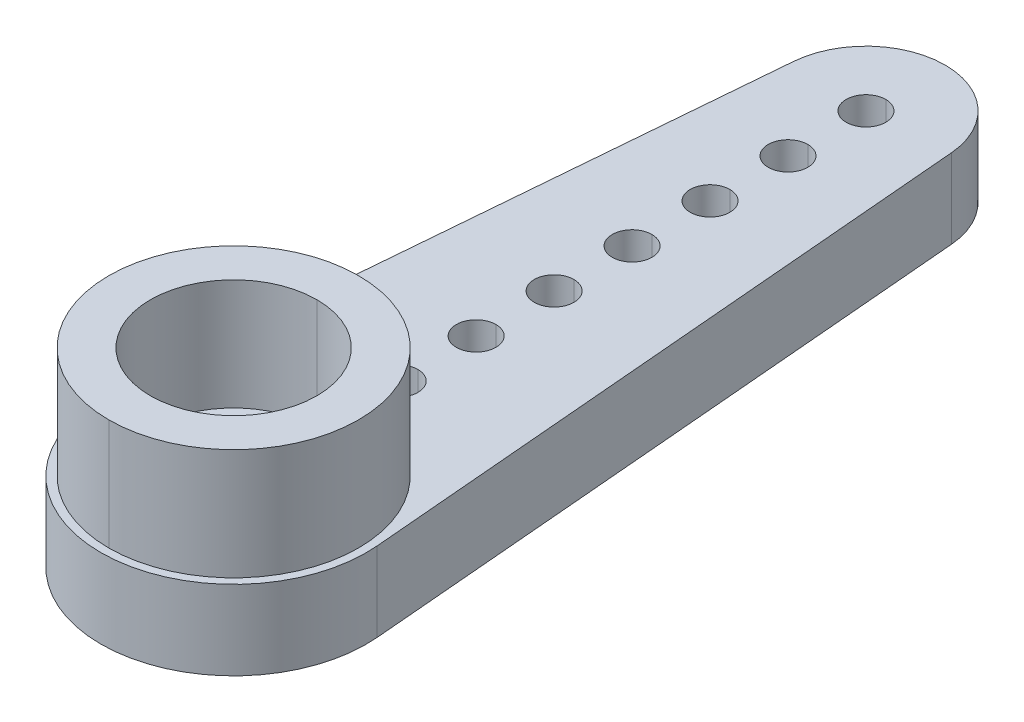
ISO-10303-21;
HEADER;
FILE_DESCRIPTION(('STEP AP214'),'2;1');
FILE_NAME('part.step','',(''),(''),'','','');
FILE_SCHEMA(('AUTOMOTIVE_DESIGN { 1 0 10303 214 1 1 1 1 }'));
ENDSEC;
DATA;
#1=APPLICATION_CONTEXT('core data for automotive mechanical design processes');
#2=APPLICATION_PROTOCOL_DEFINITION('international standard','automotive_design',2000,#1);
#3=PRODUCT_CONTEXT('',#1,'mechanical');
#4=PRODUCT('Part','Part','',(#3));
#5=PRODUCT_RELATED_PRODUCT_CATEGORY('part','',(#4));
#6=PRODUCT_DEFINITION_FORMATION('','',#4);
#7=PRODUCT_DEFINITION_CONTEXT('part definition',#1,'design');
#8=PRODUCT_DEFINITION('design','',#6,#7);
#9=PRODUCT_DEFINITION_SHAPE('','',#8);
#10=(LENGTH_UNIT() NAMED_UNIT(*) SI_UNIT(.MILLI.,.METRE.));
#11=(NAMED_UNIT(*) PLANE_ANGLE_UNIT() SI_UNIT($,.RADIAN.));
#12=(NAMED_UNIT(*) SI_UNIT($,.STERADIAN.) SOLID_ANGLE_UNIT());
#13=UNCERTAINTY_MEASURE_WITH_UNIT(LENGTH_MEASURE(1.E-05),#10,'distance_accuracy_value','');
#14=(GEOMETRIC_REPRESENTATION_CONTEXT(3) GLOBAL_UNCERTAINTY_ASSIGNED_CONTEXT((#13)) GLOBAL_UNIT_ASSIGNED_CONTEXT((#10,
#11,#12)) REPRESENTATION_CONTEXT('',''));
#15=CARTESIAN_POINT('',(0.,0.,0.));
#16=DIRECTION('',(0.,0.,1.));
#17=DIRECTION('',(1.,0.,0.));
#18=AXIS2_PLACEMENT_3D('',#15,#16,#17);
#19=CARTESIAN_POINT('',(0.,4.8,0.));
#20=DIRECTION('',(0.,-1.,0.));
#21=DIRECTION('',(0.,0.,-1.));
#22=AXIS2_PLACEMENT_3D('',#19,#20,#21);
#23=CYLINDRICAL_SURFACE('',#22,2.1);
#24=DIRECTION('',(0.,-1.,0.));
#25=VECTOR('',#24,1.);
#26=CARTESIAN_POINT('',(0.,4.8,2.1));
#27=LINE('',#26,#25);
#28=CARTESIAN_POINT('',(0.,4.8,2.1));
#29=VERTEX_POINT('',#28);
#30=CARTESIAN_POINT('',(0.,2.,2.1));
#31=VERTEX_POINT('',#30);
#32=EDGE_CURVE('E243',#29,#31,#27,.T.);
#33=ORIENTED_EDGE('',*,*,#32,.F.);
#34=CARTESIAN_POINT('',(0.,4.8,0.));
#35=DIRECTION('',(0.,1.,0.));
#36=DIRECTION('',(0.,0.,1.));
#37=AXIS2_PLACEMENT_3D('',#34,#35,#36);
#38=CIRCLE('',#37,2.1);
#39=CARTESIAN_POINT('',(0.,4.8,-2.1));
#40=VERTEX_POINT('',#39);
#41=EDGE_CURVE('E10',#29,#40,#38,.T.);
#42=ORIENTED_EDGE('',*,*,#41,.T.);
#43=DIRECTION('',(0.,-1.,0.));
#44=VECTOR('',#43,1.);
#45=CARTESIAN_POINT('',(0.,4.8,-2.1));
#46=LINE('',#45,#44);
#47=CARTESIAN_POINT('',(0.,2.,-2.1));
#48=VERTEX_POINT('',#47);
#49=EDGE_CURVE('E242',#40,#48,#46,.T.);
#50=ORIENTED_EDGE('',*,*,#49,.T.);
#51=CARTESIAN_POINT('',(0.,2.,0.));
#52=DIRECTION('',(0.,-1.,0.));
#53=DIRECTION('',(0.,0.,1.));
#54=AXIS2_PLACEMENT_3D('',#51,#52,#53);
#55=CIRCLE('',#54,2.1);
#56=EDGE_CURVE('E272',#48,#31,#55,.T.);
#57=ORIENTED_EDGE('',*,*,#56,.T.);
#58=EDGE_LOOP('',(#33,#42,#50,#57));
#59=FACE_BOUND('',#58,.T.);
#60=ADVANCED_FACE('F15',(#59),#23,.F.);
#61=CARTESIAN_POINT('',(0.,4.8,0.));
#62=DIRECTION('',(0.,-1.,0.));
#63=DIRECTION('',(0.,0.,-1.));
#64=AXIS2_PLACEMENT_3D('',#61,#62,#63);
#65=CYLINDRICAL_SURFACE('',#64,3.15);
#66=DIRECTION('',(0.,-1.,0.));
#67=VECTOR('',#66,1.);
#68=CARTESIAN_POINT('',(0.,4.8,3.15));
#69=LINE('',#68,#67);
#70=CARTESIAN_POINT('',(0.,4.8,3.15));
#71=VERTEX_POINT('',#70);
#72=CARTESIAN_POINT('',(0.,2.,3.15));
#73=VERTEX_POINT('',#72);
#74=EDGE_CURVE('E421',#71,#73,#69,.T.);
#75=ORIENTED_EDGE('',*,*,#74,.F.);
#76=CARTESIAN_POINT('',(0.,4.8,0.));
#77=DIRECTION('',(0.,1.,0.));
#78=DIRECTION('',(0.,0.,1.));
#79=AXIS2_PLACEMENT_3D('',#76,#77,#78);
#80=CIRCLE('',#79,3.15);
#81=CARTESIAN_POINT('',(0.,4.8,-3.15));
#82=VERTEX_POINT('',#81);
#83=EDGE_CURVE('E26',#82,#71,#80,.T.);
#84=ORIENTED_EDGE('',*,*,#83,.F.);
#85=DIRECTION('',(0.,-1.,0.));
#86=VECTOR('',#85,1.);
#87=CARTESIAN_POINT('',(0.,4.8,-3.15));
#88=LINE('',#87,#86);
#89=CARTESIAN_POINT('',(0.,2.,-3.15));
#90=VERTEX_POINT('',#89);
#91=EDGE_CURVE('E278',#82,#90,#88,.T.);
#92=ORIENTED_EDGE('',*,*,#91,.T.);
#93=CARTESIAN_POINT('',(0.,2.,0.));
#94=DIRECTION('',(0.,-1.,0.));
#95=DIRECTION('',(0.,0.,1.));
#96=AXIS2_PLACEMENT_3D('',#93,#94,#95);
#97=CIRCLE('',#96,3.15);
#98=EDGE_CURVE('E207',#73,#90,#97,.T.);
#99=ORIENTED_EDGE('',*,*,#98,.F.);
#100=EDGE_LOOP('',(#75,#84,#92,#99));
#101=FACE_BOUND('',#100,.T.);
#102=ADVANCED_FACE('F900',(#101),#65,.T.);
#103=CARTESIAN_POINT('',(0.,4.8,0.));
#104=DIRECTION('',(0.,1.,0.));
#105=DIRECTION('',(1.,0.,0.));
#106=AXIS2_PLACEMENT_3D('',#103,#104,#105);
#107=PLANE('',#106);
#108=CARTESIAN_POINT('',(0.,4.8,0.));
#109=DIRECTION('',(0.,1.,0.));
#110=DIRECTION('',(0.,0.,1.));
#111=AXIS2_PLACEMENT_3D('',#108,#109,#110);
#112=CIRCLE('',#111,2.1);
#113=EDGE_CURVE('E255',#40,#29,#112,.T.);
#114=ORIENTED_EDGE('',*,*,#113,.F.);
#115=ORIENTED_EDGE('',*,*,#41,.F.);
#116=EDGE_LOOP('',(#114,#115));
#117=FACE_BOUND('',#116,.T.);
#118=ORIENTED_EDGE('',*,*,#83,.T.);
#119=CARTESIAN_POINT('',(0.,4.8,0.));
#120=DIRECTION('',(0.,1.,0.));
#121=DIRECTION('',(0.,0.,1.));
#122=AXIS2_PLACEMENT_3D('',#119,#120,#121);
#123=CIRCLE('',#122,3.15);
#124=EDGE_CURVE('E425',#71,#82,#123,.T.);
#125=ORIENTED_EDGE('',*,*,#124,.T.);
#126=EDGE_LOOP('',(#118,#125));
#127=FACE_BOUND('',#126,.T.);
#128=ADVANCED_FACE('F794',(#117,#127),#107,.T.);
#129=CARTESIAN_POINT('',(1.23120827143379E-13,2.,-4.15));
#130=DIRECTION('',(0.,-1.,0.));
#131=DIRECTION('',(0.,0.,-1.));
#132=AXIS2_PLACEMENT_3D('',#129,#130,#131);
#133=CYLINDRICAL_SURFACE('',#132,0.5);
#134=DIRECTION('',(0.,-1.,0.));
#135=VECTOR('',#134,1.);
#136=CARTESIAN_POINT('',(1.23182059483337E-13,2.,-3.65));
#137=LINE('',#136,#135);
#138=CARTESIAN_POINT('',(1.23182059483337E-13,2.,-3.65));
#139=VERTEX_POINT('',#138);
#140=CARTESIAN_POINT('',(1.23182059483337E-13,0.,-3.65));
#141=VERTEX_POINT('',#140);
#142=EDGE_CURVE('E277',#139,#141,#137,.T.);
#143=ORIENTED_EDGE('',*,*,#142,.F.);
#144=CARTESIAN_POINT('',(1.23120827143379E-13,2.,-4.15));
#145=DIRECTION('',(0.,1.,0.));
#146=DIRECTION('',(0.,0.,1.));
#147=AXIS2_PLACEMENT_3D('',#144,#145,#146);
#148=CIRCLE('',#147,0.5);
#149=CARTESIAN_POINT('',(1.23120827143379E-13,2.,-4.65));
#150=VERTEX_POINT('',#149);
#151=EDGE_CURVE('E357',#139,#150,#148,.T.);
#152=ORIENTED_EDGE('',*,*,#151,.T.);
#153=DIRECTION('',(0.,-1.,0.));
#154=VECTOR('',#153,1.);
#155=CARTESIAN_POINT('',(1.23120827143379E-13,2.,-4.65));
#156=LINE('',#155,#154);
#157=CARTESIAN_POINT('',(1.23120827143379E-13,0.,-4.65));
#158=VERTEX_POINT('',#157);
#159=EDGE_CURVE('E222',#150,#158,#156,.T.);
#160=ORIENTED_EDGE('',*,*,#159,.T.);
#161=CARTESIAN_POINT('',(1.23120827143379E-13,0.,-4.15));
#162=DIRECTION('',(0.,1.,0.));
#163=DIRECTION('',(0.,0.,1.));
#164=AXIS2_PLACEMENT_3D('',#161,#162,#163);
#165=CIRCLE('',#164,0.5);
#166=EDGE_CURVE('E234',#141,#158,#165,.T.);
#167=ORIENTED_EDGE('',*,*,#166,.F.);
#168=EDGE_LOOP('',(#143,#152,#160,#167));
#169=FACE_BOUND('',#168,.T.);
#170=ADVANCED_FACE('F790',(#169),#133,.F.);
#171=CARTESIAN_POINT('',(1.02641510846121E-13,2.,-6.11666666666666));
#172=DIRECTION('',(0.,-1.,0.));
#173=DIRECTION('',(0.,0.,-1.));
#174=AXIS2_PLACEMENT_3D('',#171,#172,#173);
#175=CYLINDRICAL_SURFACE('',#174,0.5);
#176=DIRECTION('',(0.,-1.,0.));
#177=VECTOR('',#176,1.);
#178=CARTESIAN_POINT('',(1.02702743186078E-13,2.,-5.61666666666666));
#179=LINE('',#178,#177);
#180=CARTESIAN_POINT('',(1.02702743186078E-13,2.,-5.61666666666666));
#181=VERTEX_POINT('',#180);
#182=CARTESIAN_POINT('',(1.02702743186078E-13,0.,-5.61666666666666));
#183=VERTEX_POINT('',#182);
#184=EDGE_CURVE('E210',#181,#183,#179,.T.);
#185=ORIENTED_EDGE('',*,*,#184,.F.);
#186=CARTESIAN_POINT('',(1.02641510846121E-13,2.,-6.11666666666666));
#187=DIRECTION('',(0.,1.,0.));
#188=DIRECTION('',(0.,0.,1.));
#189=AXIS2_PLACEMENT_3D('',#186,#187,#188);
#190=CIRCLE('',#189,0.5);
#191=CARTESIAN_POINT('',(1.02641510846121E-13,2.,-6.61666666666666));
#192=VERTEX_POINT('',#191);
#193=EDGE_CURVE('E196',#181,#192,#190,.T.);
#194=ORIENTED_EDGE('',*,*,#193,.T.);
#195=DIRECTION('',(0.,-1.,0.));
#196=VECTOR('',#195,1.);
#197=CARTESIAN_POINT('',(1.02641510846121E-13,2.,-6.61666666666666));
#198=LINE('',#197,#196);
#199=CARTESIAN_POINT('',(1.02641510846121E-13,0.,-6.61666666666666));
#200=VERTEX_POINT('',#199);
#201=EDGE_CURVE('E220',#192,#200,#198,.T.);
#202=ORIENTED_EDGE('',*,*,#201,.T.);
#203=CARTESIAN_POINT('',(1.02641510846121E-13,0.,-6.11666666666666));
#204=DIRECTION('',(0.,1.,0.));
#205=DIRECTION('',(0.,0.,1.));
#206=AXIS2_PLACEMENT_3D('',#203,#204,#205);
#207=CIRCLE('',#206,0.5);
#208=EDGE_CURVE('E212',#183,#200,#207,.T.);
#209=ORIENTED_EDGE('',*,*,#208,.F.);
#210=EDGE_LOOP('',(#185,#194,#202,#209));
#211=FACE_BOUND('',#210,.T.);
#212=ADVANCED_FACE('F211',(#211),#175,.F.);
#213=CARTESIAN_POINT('',(0.,2.,-8.08333333333333));
#214=DIRECTION('',(0.,-1.,0.));
#215=DIRECTION('',(0.,0.,-1.));
#216=AXIS2_PLACEMENT_3D('',#213,#214,#215);
#217=CYLINDRICAL_SURFACE('',#216,0.5);
#218=DIRECTION('',(0.,-1.,0.));
#219=VECTOR('',#218,1.);
#220=CARTESIAN_POINT('',(0.,2.,-7.58333333333333));
#221=LINE('',#220,#219);
#222=CARTESIAN_POINT('',(0.,2.,-7.58333333333333));
#223=VERTEX_POINT('',#222);
#224=CARTESIAN_POINT('',(0.,0.,-7.58333333333333));
#225=VERTEX_POINT('',#224);
#226=EDGE_CURVE('E306',#223,#225,#221,.T.);
#227=ORIENTED_EDGE('',*,*,#226,.F.);
#228=CARTESIAN_POINT('',(0.,2.,-8.08333333333333));
#229=DIRECTION('',(0.,1.,0.));
#230=DIRECTION('',(0.,0.,1.));
#231=AXIS2_PLACEMENT_3D('',#228,#229,#230);
#232=CIRCLE('',#231,0.5);
#233=CARTESIAN_POINT('',(0.,2.,-8.58333333333333));
#234=VERTEX_POINT('',#233);
#235=EDGE_CURVE('E323',#223,#234,#232,.T.);
#236=ORIENTED_EDGE('',*,*,#235,.T.);
#237=DIRECTION('',(0.,-1.,0.));
#238=VECTOR('',#237,1.);
#239=CARTESIAN_POINT('',(0.,2.,-8.58333333333333));
#240=LINE('',#239,#238);
#241=CARTESIAN_POINT('',(0.,0.,-8.58333333333333));
#242=VERTEX_POINT('',#241);
#243=EDGE_CURVE('E301',#234,#242,#240,.T.);
#244=ORIENTED_EDGE('',*,*,#243,.T.);
#245=CARTESIAN_POINT('',(0.,0.,-8.08333333333333));
#246=DIRECTION('',(0.,1.,0.));
#247=DIRECTION('',(0.,0.,1.));
#248=AXIS2_PLACEMENT_3D('',#245,#246,#247);
#249=CIRCLE('',#248,0.5);
#250=EDGE_CURVE('E340',#225,#242,#249,.T.);
#251=ORIENTED_EDGE('',*,*,#250,.F.);
#252=EDGE_LOOP('',(#227,#236,#244,#251));
#253=FACE_BOUND('',#252,.T.);
#254=ADVANCED_FACE('F552',(#253),#217,.F.);
#255=CARTESIAN_POINT('',(0.,2.,-10.05));
#256=DIRECTION('',(0.,-1.,0.));
#257=DIRECTION('',(0.,0.,-1.));
#258=AXIS2_PLACEMENT_3D('',#255,#256,#257);
#259=CYLINDRICAL_SURFACE('',#258,0.5);
#260=DIRECTION('',(0.,-1.,0.));
#261=VECTOR('',#260,1.);
#262=CARTESIAN_POINT('',(0.,2.,-9.55));
#263=LINE('',#262,#261);
#264=CARTESIAN_POINT('',(0.,2.,-9.55));
#265=VERTEX_POINT('',#264);
#266=CARTESIAN_POINT('',(0.,0.,-9.55));
#267=VERTEX_POINT('',#266);
#268=EDGE_CURVE('E282',#265,#267,#263,.T.);
#269=ORIENTED_EDGE('',*,*,#268,.F.);
#270=CARTESIAN_POINT('',(0.,2.,-10.05));
#271=DIRECTION('',(0.,1.,0.));
#272=DIRECTION('',(0.,0.,1.));
#273=AXIS2_PLACEMENT_3D('',#270,#271,#272);
#274=CIRCLE('',#273,0.5);
#275=CARTESIAN_POINT('',(0.,2.,-10.55));
#276=VERTEX_POINT('',#275);
#277=EDGE_CURVE('E206',#265,#276,#274,.T.);
#278=ORIENTED_EDGE('',*,*,#277,.T.);
#279=DIRECTION('',(0.,-1.,0.));
#280=VECTOR('',#279,1.);
#281=CARTESIAN_POINT('',(0.,2.,-10.55));
#282=LINE('',#281,#280);
#283=CARTESIAN_POINT('',(0.,0.,-10.55));
#284=VERTEX_POINT('',#283);
#285=EDGE_CURVE('E380',#276,#284,#282,.T.);
#286=ORIENTED_EDGE('',*,*,#285,.T.);
#287=CARTESIAN_POINT('',(0.,0.,-10.05));
#288=DIRECTION('',(0.,1.,0.));
#289=DIRECTION('',(0.,0.,1.));
#290=AXIS2_PLACEMENT_3D('',#287,#288,#289);
#291=CIRCLE('',#290,0.5);
#292=EDGE_CURVE('E337',#267,#284,#291,.T.);
#293=ORIENTED_EDGE('',*,*,#292,.F.);
#294=EDGE_LOOP('',(#269,#278,#286,#293));
#295=FACE_BOUND('',#294,.T.);
#296=ADVANCED_FACE('F579',(#295),#259,.F.);
#297=CARTESIAN_POINT('',(0.,2.,-12.0166666666667));
#298=DIRECTION('',(0.,-1.,0.));
#299=DIRECTION('',(0.,0.,-1.));
#300=AXIS2_PLACEMENT_3D('',#297,#298,#299);
#301=CYLINDRICAL_SURFACE('',#300,0.5);
#302=DIRECTION('',(0.,-1.,0.));
#303=VECTOR('',#302,1.);
#304=CARTESIAN_POINT('',(0.,2.,-11.5166666666667));
#305=LINE('',#304,#303);
#306=CARTESIAN_POINT('',(0.,2.,-11.5166666666667));
#307=VERTEX_POINT('',#306);
#308=CARTESIAN_POINT('',(0.,0.,-11.5166666666667));
#309=VERTEX_POINT('',#308);
#310=EDGE_CURVE('E244',#307,#309,#305,.T.);
#311=ORIENTED_EDGE('',*,*,#310,.F.);
#312=CARTESIAN_POINT('',(0.,2.,-12.0166666666667));
#313=DIRECTION('',(0.,1.,0.));
#314=DIRECTION('',(0.,0.,1.));
#315=AXIS2_PLACEMENT_3D('',#312,#313,#314);
#316=CIRCLE('',#315,0.5);
#317=CARTESIAN_POINT('',(0.,2.,-12.5166666666667));
#318=VERTEX_POINT('',#317);
#319=EDGE_CURVE('E319',#307,#318,#316,.T.);
#320=ORIENTED_EDGE('',*,*,#319,.T.);
#321=DIRECTION('',(0.,-1.,0.));
#322=VECTOR('',#321,1.);
#323=CARTESIAN_POINT('',(0.,2.,-12.5166666666667));
#324=LINE('',#323,#322);
#325=CARTESIAN_POINT('',(0.,0.,-12.5166666666667));
#326=VERTEX_POINT('',#325);
#327=EDGE_CURVE('E395',#318,#326,#324,.T.);
#328=ORIENTED_EDGE('',*,*,#327,.T.);
#329=CARTESIAN_POINT('',(0.,0.,-12.0166666666667));
#330=DIRECTION('',(0.,1.,0.));
#331=DIRECTION('',(0.,0.,1.));
#332=AXIS2_PLACEMENT_3D('',#329,#330,#331);
#333=CIRCLE('',#332,0.5);
#334=EDGE_CURVE('E341',#309,#326,#333,.T.);
#335=ORIENTED_EDGE('',*,*,#334,.F.);
#336=EDGE_LOOP('',(#311,#320,#328,#335));
#337=FACE_BOUND('',#336,.T.);
#338=ADVANCED_FACE('F933',(#337),#301,.F.);
#339=CARTESIAN_POINT('',(0.,2.,-13.9833333333333));
#340=DIRECTION('',(0.,-1.,0.));
#341=DIRECTION('',(0.,0.,-1.));
#342=AXIS2_PLACEMENT_3D('',#339,#340,#341);
#343=CYLINDRICAL_SURFACE('',#342,0.5);
#344=DIRECTION('',(0.,-1.,0.));
#345=VECTOR('',#344,1.);
#346=CARTESIAN_POINT('',(0.,2.,-13.4833333333333));
#347=LINE('',#346,#345);
#348=CARTESIAN_POINT('',(0.,2.,-13.4833333333333));
#349=VERTEX_POINT('',#348);
#350=CARTESIAN_POINT('',(0.,0.,-13.4833333333333));
#351=VERTEX_POINT('',#350);
#352=EDGE_CURVE('E254',#349,#351,#347,.T.);
#353=ORIENTED_EDGE('',*,*,#352,.F.);
#354=CARTESIAN_POINT('',(0.,2.,-13.9833333333333));
#355=DIRECTION('',(0.,1.,0.));
#356=DIRECTION('',(0.,0.,1.));
#357=AXIS2_PLACEMENT_3D('',#354,#355,#356);
#358=CIRCLE('',#357,0.5);
#359=CARTESIAN_POINT('',(0.,2.,-14.4833333333333));
#360=VERTEX_POINT('',#359);
#361=EDGE_CURVE('E307',#349,#360,#358,.T.);
#362=ORIENTED_EDGE('',*,*,#361,.T.);
#363=DIRECTION('',(0.,-1.,0.));
#364=VECTOR('',#363,1.);
#365=CARTESIAN_POINT('',(0.,2.,-14.4833333333333));
#366=LINE('',#365,#364);
#367=CARTESIAN_POINT('',(0.,0.,-14.4833333333333));
#368=VERTEX_POINT('',#367);
#369=EDGE_CURVE('E253',#360,#368,#366,.T.);
#370=ORIENTED_EDGE('',*,*,#369,.T.);
#371=CARTESIAN_POINT('',(0.,0.,-13.9833333333333));
#372=DIRECTION('',(0.,1.,0.));
#373=DIRECTION('',(0.,0.,1.));
#374=AXIS2_PLACEMENT_3D('',#371,#372,#373);
#375=CIRCLE('',#374,0.5);
#376=EDGE_CURVE('E403',#351,#368,#375,.T.);
#377=ORIENTED_EDGE('',*,*,#376,.F.);
#378=EDGE_LOOP('',(#353,#362,#370,#377));
#379=FACE_BOUND('',#378,.T.);
#380=ADVANCED_FACE('F590',(#379),#343,.F.);
#381=CARTESIAN_POINT('',(0.,2.,-15.95));
#382=DIRECTION('',(0.,-1.,0.));
#383=DIRECTION('',(0.,0.,-1.));
#384=AXIS2_PLACEMENT_3D('',#381,#382,#383);
#385=CYLINDRICAL_SURFACE('',#384,0.5);
#386=DIRECTION('',(0.,-1.,0.));
#387=VECTOR('',#386,1.);
#388=CARTESIAN_POINT('',(0.,2.,-15.45));
#389=LINE('',#388,#387);
#390=CARTESIAN_POINT('',(0.,2.,-15.45));
#391=VERTEX_POINT('',#390);
#392=CARTESIAN_POINT('',(0.,0.,-15.45));
#393=VERTEX_POINT('',#392);
#394=EDGE_CURVE('E336',#391,#393,#389,.T.);
#395=ORIENTED_EDGE('',*,*,#394,.F.);
#396=CARTESIAN_POINT('',(0.,2.,-15.95));
#397=DIRECTION('',(0.,1.,0.));
#398=DIRECTION('',(0.,0.,1.));
#399=AXIS2_PLACEMENT_3D('',#396,#397,#398);
#400=CIRCLE('',#399,0.5);
#401=CARTESIAN_POINT('',(0.,2.,-16.45));
#402=VERTEX_POINT('',#401);
#403=EDGE_CURVE('E310',#391,#402,#400,.T.);
#404=ORIENTED_EDGE('',*,*,#403,.T.);
#405=DIRECTION('',(0.,-1.,0.));
#406=VECTOR('',#405,1.);
#407=CARTESIAN_POINT('',(0.,2.,-16.45));
#408=LINE('',#407,#406);
#409=CARTESIAN_POINT('',(0.,0.,-16.45));
#410=VERTEX_POINT('',#409);
#411=EDGE_CURVE('E346',#402,#410,#408,.T.);
#412=ORIENTED_EDGE('',*,*,#411,.T.);
#413=CARTESIAN_POINT('',(0.,0.,-15.95));
#414=DIRECTION('',(0.,1.,0.));
#415=DIRECTION('',(0.,0.,1.));
#416=AXIS2_PLACEMENT_3D('',#413,#414,#415);
#417=CIRCLE('',#416,0.5);
#418=EDGE_CURVE('E400',#393,#410,#417,.T.);
#419=ORIENTED_EDGE('',*,*,#418,.F.);
#420=EDGE_LOOP('',(#395,#404,#412,#419));
#421=FACE_BOUND('',#420,.T.);
#422=ADVANCED_FACE('F483',(#421),#385,.F.);
#423=CARTESIAN_POINT('',(0.,2.,0.));
#424=DIRECTION('',(0.,-1.,0.));
#425=DIRECTION('',(0.,0.,-1.));
#426=AXIS2_PLACEMENT_3D('',#423,#424,#425);
#427=CYLINDRICAL_SURFACE('',#426,1.15);
#428=DIRECTION('',(0.,-1.,0.));
#429=VECTOR('',#428,1.);
#430=CARTESIAN_POINT('',(0.,2.,1.15));
#431=LINE('',#430,#429);
#432=CARTESIAN_POINT('',(0.,2.,1.15));
#433=VERTEX_POINT('',#432);
#434=CARTESIAN_POINT('',(0.,0.,1.15));
#435=VERTEX_POINT('',#434);
#436=EDGE_CURVE('E324',#433,#435,#431,.T.);
#437=ORIENTED_EDGE('',*,*,#436,.F.);
#438=CARTESIAN_POINT('',(0.,2.,0.));
#439=DIRECTION('',(0.,1.,0.));
#440=DIRECTION('',(0.,0.,1.));
#441=AXIS2_PLACEMENT_3D('',#438,#439,#440);
#442=CIRCLE('',#441,1.15);
#443=CARTESIAN_POINT('',(0.,2.,-1.15));
#444=VERTEX_POINT('',#443);
#445=EDGE_CURVE('E268',#433,#444,#442,.T.);
#446=ORIENTED_EDGE('',*,*,#445,.T.);
#447=DIRECTION('',(0.,-1.,0.));
#448=VECTOR('',#447,1.);
#449=CARTESIAN_POINT('',(0.,2.,-1.15));
#450=LINE('',#449,#448);
#451=CARTESIAN_POINT('',(0.,0.,-1.15));
#452=VERTEX_POINT('',#451);
#453=EDGE_CURVE('E360',#444,#452,#450,.T.);
#454=ORIENTED_EDGE('',*,*,#453,.T.);
#455=CARTESIAN_POINT('',(0.,0.,0.));
#456=DIRECTION('',(0.,1.,0.));
#457=DIRECTION('',(0.,0.,1.));
#458=AXIS2_PLACEMENT_3D('',#455,#456,#457);
#459=CIRCLE('',#458,1.15);
#460=EDGE_CURVE('E237',#435,#452,#459,.T.);
#461=ORIENTED_EDGE('',*,*,#460,.F.);
#462=EDGE_LOOP('',(#437,#446,#454,#461));
#463=FACE_BOUND('',#462,.T.);
#464=ADVANCED_FACE('F855',(#463),#427,.F.);
#465=CARTESIAN_POINT('',(-3.33797899228129,2.,-0.283542319749215));
#466=DIRECTION('',(0.996411639486953,0.,0.0846394984326016));
#467=DIRECTION('',(0.,-1.,0.));
#468=AXIS2_PLACEMENT_3D('',#465,#466,#467);
#469=PLANE('',#468);
#470=DIRECTION('',(-0.0846394984326016,0.,0.996411639486953));
#471=VECTOR('',#470,1.);
#472=CARTESIAN_POINT('',(-3.33797899228129,0.,-0.283542319749215));
#473=LINE('',#472,#471);
#474=CARTESIAN_POINT('',(-1.99282327897391,0.,-16.1192789968652));
#475=VERTEX_POINT('',#474);
#476=CARTESIAN_POINT('',(-3.33797899228129,0.,-0.283542319749215));
#477=VERTEX_POINT('',#476);
#478=EDGE_CURVE('E356',#475,#477,#473,.T.);
#479=ORIENTED_EDGE('',*,*,#478,.T.);
#480=DIRECTION('',(0.,-1.,0.));
#481=VECTOR('',#480,1.);
#482=CARTESIAN_POINT('',(-3.33797899228129,2.,-0.283542319749215));
#483=LINE('',#482,#481);
#484=CARTESIAN_POINT('',(-3.33797899228129,2.,-0.283542319749215));
#485=VERTEX_POINT('',#484);
#486=EDGE_CURVE('E391',#485,#477,#483,.T.);
#487=ORIENTED_EDGE('',*,*,#486,.F.);
#488=DIRECTION('',(-0.0846394984326016,0.,0.996411639486953));
#489=VECTOR('',#488,1.);
#490=CARTESIAN_POINT('',(-3.33797899228129,2.,-0.283542319749215));
#491=LINE('',#490,#489);
#492=CARTESIAN_POINT('',(-1.99282327897391,2.,-16.1192789968652));
#493=VERTEX_POINT('',#492);
#494=EDGE_CURVE('E19',#493,#485,#491,.T.);
#495=ORIENTED_EDGE('',*,*,#494,.F.);
#496=DIRECTION('',(0.,-1.,0.));
#497=VECTOR('',#496,1.);
#498=CARTESIAN_POINT('',(-1.99282327897391,2.,-16.1192789968652));
#499=LINE('',#498,#497);
#500=EDGE_CURVE('E281',#493,#475,#499,.T.);
#501=ORIENTED_EDGE('',*,*,#500,.T.);
#502=EDGE_LOOP('',(#479,#487,#495,#501));
#503=FACE_BOUND('',#502,.T.);
#504=ADVANCED_FACE('F501',(#503),#469,.F.);
#505=CARTESIAN_POINT('',(0.,2.,-15.95));
#506=DIRECTION('',(0.,-1.,0.));
#507=DIRECTION('',(0.,0.,-1.));
#508=AXIS2_PLACEMENT_3D('',#505,#506,#507);
#509=CYLINDRICAL_SURFACE('',#508,2.);
#510=DIRECTION('',(0.,-1.,0.));
#511=VECTOR('',#510,1.);
#512=CARTESIAN_POINT('',(0.,2.,-17.95));
#513=LINE('',#512,#511);
#514=CARTESIAN_POINT('',(0.,2.,-17.95));
#515=VERTEX_POINT('',#514);
#516=CARTESIAN_POINT('',(0.,0.,-17.95));
#517=VERTEX_POINT('',#516);
#518=EDGE_CURVE('E262',#515,#517,#513,.T.);
#519=ORIENTED_EDGE('',*,*,#518,.F.);
#520=CARTESIAN_POINT('',(0.,2.,-15.95));
#521=DIRECTION('',(0.,1.,0.));
#522=DIRECTION('',(0.,0.,1.));
#523=AXIS2_PLACEMENT_3D('',#520,#521,#522);
#524=CIRCLE('',#523,2.);
#525=CARTESIAN_POINT('',(1.99282327897391,2.,-16.1192789968652));
#526=VERTEX_POINT('',#525);
#527=EDGE_CURVE('E314',#526,#515,#524,.T.);
#528=ORIENTED_EDGE('',*,*,#527,.F.);
#529=DIRECTION('',(0.,-1.,0.));
#530=VECTOR('',#529,1.);
#531=CARTESIAN_POINT('',(1.99282327897391,2.,-16.1192789968652));
#532=LINE('',#531,#530);
#533=CARTESIAN_POINT('',(1.99282327897391,0.,-16.1192789968652));
#534=VERTEX_POINT('',#533);
#535=EDGE_CURVE('E41',#526,#534,#532,.T.);
#536=ORIENTED_EDGE('',*,*,#535,.T.);
#537=CARTESIAN_POINT('',(0.,0.,-15.95));
#538=DIRECTION('',(0.,1.,0.));
#539=DIRECTION('',(0.,0.,1.));
#540=AXIS2_PLACEMENT_3D('',#537,#538,#539);
#541=CIRCLE('',#540,2.);
#542=EDGE_CURVE('E408',#534,#517,#541,.T.);
#543=ORIENTED_EDGE('',*,*,#542,.T.);
#544=EDGE_LOOP('',(#519,#528,#536,#543));
#545=FACE_BOUND('',#544,.T.);
#546=ADVANCED_FACE('F17',(#545),#509,.T.);
#547=CARTESIAN_POINT('',(1.99282327897391,2.,-16.1192789968652));
#548=DIRECTION('',(-0.996411639486953,0.,0.0846394984326016));
#549=DIRECTION('',(0.,1.,0.));
#550=AXIS2_PLACEMENT_3D('',#547,#548,#549);
#551=PLANE('',#550);
#552=DIRECTION('',(-0.0846394984326016,0.,-0.996411639486953));
#553=VECTOR('',#552,1.);
#554=CARTESIAN_POINT('',(1.99282327897391,0.,-16.1192789968652));
#555=LINE('',#554,#553);
#556=CARTESIAN_POINT('',(3.33797899228129,0.,-0.283542319749215));
#557=VERTEX_POINT('',#556);
#558=EDGE_CURVE('E404',#557,#534,#555,.T.);
#559=ORIENTED_EDGE('',*,*,#558,.T.);
#560=ORIENTED_EDGE('',*,*,#535,.F.);
#561=DIRECTION('',(-0.0846394984326016,0.,-0.996411639486953));
#562=VECTOR('',#561,1.);
#563=CARTESIAN_POINT('',(1.99282327897391,2.,-16.1192789968652));
#564=LINE('',#563,#562);
#565=CARTESIAN_POINT('',(3.33797899228129,2.,-0.283542319749215));
#566=VERTEX_POINT('',#565);
#567=EDGE_CURVE('E318',#566,#526,#564,.T.);
#568=ORIENTED_EDGE('',*,*,#567,.F.);
#569=DIRECTION('',(0.,-1.,0.));
#570=VECTOR('',#569,1.);
#571=CARTESIAN_POINT('',(3.33797899228129,2.,-0.283542319749215));
#572=LINE('',#571,#570);
#573=EDGE_CURVE('E393',#566,#557,#572,.T.);
#574=ORIENTED_EDGE('',*,*,#573,.T.);
#575=EDGE_LOOP('',(#559,#560,#568,#574));
#576=FACE_BOUND('',#575,.T.);
#577=ADVANCED_FACE('F784',(#576),#551,.F.);
#578=CARTESIAN_POINT('',(0.,2.,0.));
#579=DIRECTION('',(0.,-1.,0.));
#580=DIRECTION('',(0.,0.,-1.));
#581=AXIS2_PLACEMENT_3D('',#578,#579,#580);
#582=CYLINDRICAL_SURFACE('',#581,3.35);
#583=CARTESIAN_POINT('',(0.,0.,0.));
#584=DIRECTION('',(0.,1.,0.));
#585=DIRECTION('',(0.,0.,1.));
#586=AXIS2_PLACEMENT_3D('',#583,#584,#585);
#587=CIRCLE('',#586,3.35);
#588=EDGE_CURVE('E352',#477,#557,#587,.T.);
#589=ORIENTED_EDGE('',*,*,#588,.T.);
#590=ORIENTED_EDGE('',*,*,#573,.F.);
#591=CARTESIAN_POINT('',(0.,2.,0.));
#592=DIRECTION('',(0.,1.,0.));
#593=DIRECTION('',(0.,0.,1.));
#594=AXIS2_PLACEMENT_3D('',#591,#592,#593);
#595=CIRCLE('',#594,3.35);
#596=EDGE_CURVE('E271',#485,#566,#595,.T.);
#597=ORIENTED_EDGE('',*,*,#596,.F.);
#598=ORIENTED_EDGE('',*,*,#486,.T.);
#599=EDGE_LOOP('',(#589,#590,#597,#598));
#600=FACE_BOUND('',#599,.T.);
#601=ADVANCED_FACE('F488',(#600),#582,.T.);
#602=CARTESIAN_POINT('',(0.,0.,0.));
#603=DIRECTION('',(0.,1.,0.));
#604=DIRECTION('',(1.,0.,0.));
#605=AXIS2_PLACEMENT_3D('',#602,#603,#604);
#606=PLANE('',#605);
#607=CARTESIAN_POINT('',(0.,0.,0.));
#608=DIRECTION('',(0.,1.,0.));
#609=DIRECTION('',(0.,0.,1.));
#610=AXIS2_PLACEMENT_3D('',#607,#608,#609);
#611=CIRCLE('',#610,1.15);
#612=EDGE_CURVE('E328',#452,#435,#611,.T.);
#613=ORIENTED_EDGE('',*,*,#612,.T.);
#614=ORIENTED_EDGE('',*,*,#460,.T.);
#615=EDGE_LOOP('',(#613,#614));
#616=FACE_BOUND('',#615,.T.);
#617=CARTESIAN_POINT('',(1.23120827143379E-13,0.,-4.15));
#618=DIRECTION('',(0.,1.,0.));
#619=DIRECTION('',(0.,0.,1.));
#620=AXIS2_PLACEMENT_3D('',#617,#618,#619);
#621=CIRCLE('',#620,0.5);
#622=EDGE_CURVE('E229',#158,#141,#621,.T.);
#623=ORIENTED_EDGE('',*,*,#622,.T.);
#624=ORIENTED_EDGE('',*,*,#166,.T.);
#625=EDGE_LOOP('',(#623,#624));
#626=FACE_BOUND('',#625,.T.);
#627=CARTESIAN_POINT('',(1.02641510846121E-13,0.,-6.11666666666666));
#628=DIRECTION('',(0.,1.,0.));
#629=DIRECTION('',(0.,0.,1.));
#630=AXIS2_PLACEMENT_3D('',#627,#628,#629);
#631=CIRCLE('',#630,0.5);
#632=EDGE_CURVE('E217',#200,#183,#631,.T.);
#633=ORIENTED_EDGE('',*,*,#632,.T.);
#634=ORIENTED_EDGE('',*,*,#208,.T.);
#635=EDGE_LOOP('',(#633,#634));
#636=FACE_BOUND('',#635,.T.);
#637=CARTESIAN_POINT('',(0.,0.,-8.08333333333333));
#638=DIRECTION('',(0.,1.,0.));
#639=DIRECTION('',(0.,0.,1.));
#640=AXIS2_PLACEMENT_3D('',#637,#638,#639);
#641=CIRCLE('',#640,0.5);
#642=EDGE_CURVE('E302',#242,#225,#641,.T.);
#643=ORIENTED_EDGE('',*,*,#642,.T.);
#644=ORIENTED_EDGE('',*,*,#250,.T.);
#645=EDGE_LOOP('',(#643,#644));
#646=FACE_BOUND('',#645,.T.);
#647=CARTESIAN_POINT('',(0.,0.,-10.05));
#648=DIRECTION('',(0.,1.,0.));
#649=DIRECTION('',(0.,0.,1.));
#650=AXIS2_PLACEMENT_3D('',#647,#648,#649);
#651=CIRCLE('',#650,0.5);
#652=EDGE_CURVE('E286',#284,#267,#651,.T.);
#653=ORIENTED_EDGE('',*,*,#652,.T.);
#654=ORIENTED_EDGE('',*,*,#292,.T.);
#655=EDGE_LOOP('',(#653,#654));
#656=FACE_BOUND('',#655,.T.);
#657=CARTESIAN_POINT('',(0.,0.,-12.0166666666667));
#658=DIRECTION('',(0.,1.,0.));
#659=DIRECTION('',(0.,0.,1.));
#660=AXIS2_PLACEMENT_3D('',#657,#658,#659);
#661=CIRCLE('',#660,0.5);
#662=EDGE_CURVE('E233',#326,#309,#661,.T.);
#663=ORIENTED_EDGE('',*,*,#662,.T.);
#664=ORIENTED_EDGE('',*,*,#334,.T.);
#665=EDGE_LOOP('',(#663,#664));
#666=FACE_BOUND('',#665,.T.);
#667=CARTESIAN_POINT('',(0.,0.,-13.9833333333333));
#668=DIRECTION('',(0.,1.,0.));
#669=DIRECTION('',(0.,0.,1.));
#670=AXIS2_PLACEMENT_3D('',#667,#668,#669);
#671=CIRCLE('',#670,0.5);
#672=EDGE_CURVE('E249',#368,#351,#671,.T.);
#673=ORIENTED_EDGE('',*,*,#672,.T.);
#674=ORIENTED_EDGE('',*,*,#376,.T.);
#675=EDGE_LOOP('',(#673,#674));
#676=FACE_BOUND('',#675,.T.);
#677=CARTESIAN_POINT('',(0.,0.,-15.95));
#678=DIRECTION('',(0.,1.,0.));
#679=DIRECTION('',(0.,0.,1.));
#680=AXIS2_PLACEMENT_3D('',#677,#678,#679);
#681=CIRCLE('',#680,0.5);
#682=EDGE_CURVE('E342',#410,#393,#681,.T.);
#683=ORIENTED_EDGE('',*,*,#682,.T.);
#684=ORIENTED_EDGE('',*,*,#418,.T.);
#685=EDGE_LOOP('',(#683,#684));
#686=FACE_BOUND('',#685,.T.);
#687=ORIENTED_EDGE('',*,*,#588,.F.);
#688=ORIENTED_EDGE('',*,*,#478,.F.);
#689=CARTESIAN_POINT('',(0.,0.,-15.95));
#690=DIRECTION('',(0.,1.,0.));
#691=DIRECTION('',(0.,0.,1.));
#692=AXIS2_PLACEMENT_3D('',#689,#690,#691);
#693=CIRCLE('',#692,2.);
#694=EDGE_CURVE('E266',#517,#475,#693,.T.);
#695=ORIENTED_EDGE('',*,*,#694,.F.);
#696=ORIENTED_EDGE('',*,*,#542,.F.);
#697=ORIENTED_EDGE('',*,*,#558,.F.);
#698=EDGE_LOOP('',(#687,#688,#695,#696,#697));
#699=FACE_BOUND('',#698,.T.);
#700=ADVANCED_FACE('F485',(#616,#626,#636,#646,#656,#666,#676,#686,#699),#606,.F.);
#701=CARTESIAN_POINT('',(0.,2.,0.));
#702=DIRECTION('',(0.,1.,0.));
#703=DIRECTION('',(1.,0.,0.));
#704=AXIS2_PLACEMENT_3D('',#701,#702,#703);
#705=PLANE('',#704);
#706=CARTESIAN_POINT('',(1.23120827143379E-13,2.,-4.15));
#707=DIRECTION('',(0.,1.,0.));
#708=DIRECTION('',(0.,0.,1.));
#709=AXIS2_PLACEMENT_3D('',#706,#707,#708);
#710=CIRCLE('',#709,0.5);
#711=EDGE_CURVE('E273',#150,#139,#710,.T.);
#712=ORIENTED_EDGE('',*,*,#711,.F.);
#713=ORIENTED_EDGE('',*,*,#151,.F.);
#714=EDGE_LOOP('',(#712,#713));
#715=FACE_BOUND('',#714,.T.);
#716=CARTESIAN_POINT('',(0.,2.,-8.08333333333333));
#717=DIRECTION('',(0.,1.,0.));
#718=DIRECTION('',(0.,0.,1.));
#719=AXIS2_PLACEMENT_3D('',#716,#717,#718);
#720=CIRCLE('',#719,0.5);
#721=EDGE_CURVE('E261',#234,#223,#720,.T.);
#722=ORIENTED_EDGE('',*,*,#721,.F.);
#723=ORIENTED_EDGE('',*,*,#235,.F.);
#724=EDGE_LOOP('',(#722,#723));
#725=FACE_BOUND('',#724,.T.);
#726=CARTESIAN_POINT('',(0.,2.,-12.0166666666667));
#727=DIRECTION('',(0.,1.,0.));
#728=DIRECTION('',(0.,0.,1.));
#729=AXIS2_PLACEMENT_3D('',#726,#727,#728);
#730=CIRCLE('',#729,0.5);
#731=EDGE_CURVE('E248',#318,#307,#730,.T.);
#732=ORIENTED_EDGE('',*,*,#731,.F.);
#733=ORIENTED_EDGE('',*,*,#319,.F.);
#734=EDGE_LOOP('',(#732,#733));
#735=FACE_BOUND('',#734,.T.);
#736=CARTESIAN_POINT('',(0.,2.,-15.95));
#737=DIRECTION('',(0.,1.,0.));
#738=DIRECTION('',(0.,0.,1.));
#739=AXIS2_PLACEMENT_3D('',#736,#737,#738);
#740=CIRCLE('',#739,0.5);
#741=EDGE_CURVE('E291',#402,#391,#740,.T.);
#742=ORIENTED_EDGE('',*,*,#741,.F.);
#743=ORIENTED_EDGE('',*,*,#403,.F.);
#744=EDGE_LOOP('',(#742,#743));
#745=FACE_BOUND('',#744,.T.);
#746=CARTESIAN_POINT('',(0.,2.,-13.9833333333333));
#747=DIRECTION('',(0.,1.,0.));
#748=DIRECTION('',(0.,0.,1.));
#749=AXIS2_PLACEMENT_3D('',#746,#747,#748);
#750=CIRCLE('',#749,0.5);
#751=EDGE_CURVE('E399',#360,#349,#750,.T.);
#752=ORIENTED_EDGE('',*,*,#751,.F.);
#753=ORIENTED_EDGE('',*,*,#361,.F.);
#754=EDGE_LOOP('',(#752,#753));
#755=FACE_BOUND('',#754,.T.);
#756=CARTESIAN_POINT('',(0.,2.,-10.05));
#757=DIRECTION('',(0.,1.,0.));
#758=DIRECTION('',(0.,0.,1.));
#759=AXIS2_PLACEMENT_3D('',#756,#757,#758);
#760=CIRCLE('',#759,0.5);
#761=EDGE_CURVE('E287',#276,#265,#760,.T.);
#762=ORIENTED_EDGE('',*,*,#761,.F.);
#763=ORIENTED_EDGE('',*,*,#277,.F.);
#764=EDGE_LOOP('',(#762,#763));
#765=FACE_BOUND('',#764,.T.);
#766=CARTESIAN_POINT('',(1.02641510846121E-13,2.,-6.11666666666666));
#767=DIRECTION('',(0.,1.,0.));
#768=DIRECTION('',(0.,0.,1.));
#769=AXIS2_PLACEMENT_3D('',#766,#767,#768);
#770=CIRCLE('',#769,0.5);
#771=EDGE_CURVE('E201',#192,#181,#770,.T.);
#772=ORIENTED_EDGE('',*,*,#771,.F.);
#773=ORIENTED_EDGE('',*,*,#193,.F.);
#774=EDGE_LOOP('',(#772,#773));
#775=FACE_BOUND('',#774,.T.);
#776=CARTESIAN_POINT('',(0.,2.,0.));
#777=DIRECTION('',(0.,-1.,0.));
#778=DIRECTION('',(0.,0.,1.));
#779=AXIS2_PLACEMENT_3D('',#776,#777,#778);
#780=CIRCLE('',#779,3.15);
#781=EDGE_CURVE('E414',#90,#73,#780,.T.);
#782=ORIENTED_EDGE('',*,*,#781,.T.);
#783=ORIENTED_EDGE('',*,*,#98,.T.);
#784=EDGE_LOOP('',(#782,#783));
#785=FACE_BOUND('',#784,.T.);
#786=ORIENTED_EDGE('',*,*,#596,.T.);
#787=ORIENTED_EDGE('',*,*,#567,.T.);
#788=ORIENTED_EDGE('',*,*,#527,.T.);
#789=CARTESIAN_POINT('',(0.,2.,-15.95));
#790=DIRECTION('',(0.,1.,0.));
#791=DIRECTION('',(0.,0.,1.));
#792=AXIS2_PLACEMENT_3D('',#789,#790,#791);
#793=CIRCLE('',#792,2.);
#794=EDGE_CURVE('E267',#515,#493,#793,.T.);
#795=ORIENTED_EDGE('',*,*,#794,.T.);
#796=ORIENTED_EDGE('',*,*,#494,.T.);
#797=EDGE_LOOP('',(#786,#787,#788,#795,#796));
#798=FACE_BOUND('',#797,.T.);
#799=ADVANCED_FACE('F198',(#715,#725,#735,#745,#755,#765,#775,#785,#798),#705,.T.);
#800=CARTESIAN_POINT('',(0.,2.,0.));
#801=DIRECTION('',(0.,1.,0.));
#802=DIRECTION('',(1.,0.,0.));
#803=AXIS2_PLACEMENT_3D('',#800,#801,#802);
#804=PLANE('',#803);
#805=CARTESIAN_POINT('',(0.,2.,0.));
#806=DIRECTION('',(0.,1.,0.));
#807=DIRECTION('',(0.,0.,1.));
#808=AXIS2_PLACEMENT_3D('',#805,#806,#807);
#809=CIRCLE('',#808,1.15);
#810=EDGE_CURVE('E329',#444,#433,#809,.T.);
#811=ORIENTED_EDGE('',*,*,#810,.F.);
#812=ORIENTED_EDGE('',*,*,#445,.F.);
#813=EDGE_LOOP('',(#811,#812));
#814=FACE_BOUND('',#813,.T.);
#815=ORIENTED_EDGE('',*,*,#56,.F.);
#816=CARTESIAN_POINT('',(0.,2.,0.));
#817=DIRECTION('',(0.,-1.,0.));
#818=DIRECTION('',(0.,0.,1.));
#819=AXIS2_PLACEMENT_3D('',#816,#817,#818);
#820=CIRCLE('',#819,2.1);
#821=EDGE_CURVE('E238',#31,#48,#820,.T.);
#822=ORIENTED_EDGE('',*,*,#821,.F.);
#823=EDGE_LOOP('',(#815,#822));
#824=FACE_BOUND('',#823,.T.);
#825=ADVANCED_FACE('F563',(#814,#824),#804,.T.);
#826=CARTESIAN_POINT('',(0.,2.,-15.95));
#827=DIRECTION('',(0.,-1.,0.));
#828=DIRECTION('',(0.,0.,-1.));
#829=AXIS2_PLACEMENT_3D('',#826,#827,#828);
#830=CYLINDRICAL_SURFACE('',#829,2.);
#831=ORIENTED_EDGE('',*,*,#794,.F.);
#832=ORIENTED_EDGE('',*,*,#518,.T.);
#833=ORIENTED_EDGE('',*,*,#694,.T.);
#834=ORIENTED_EDGE('',*,*,#500,.F.);
#835=EDGE_LOOP('',(#831,#832,#833,#834));
#836=FACE_BOUND('',#835,.T.);
#837=ADVANCED_FACE('F505',(#836),#830,.T.);
#838=CARTESIAN_POINT('',(0.,2.,0.));
#839=DIRECTION('',(0.,-1.,0.));
#840=DIRECTION('',(0.,0.,-1.));
#841=AXIS2_PLACEMENT_3D('',#838,#839,#840);
#842=CYLINDRICAL_SURFACE('',#841,1.15);
#843=ORIENTED_EDGE('',*,*,#810,.T.);
#844=ORIENTED_EDGE('',*,*,#436,.T.);
#845=ORIENTED_EDGE('',*,*,#612,.F.);
#846=ORIENTED_EDGE('',*,*,#453,.F.);
#847=EDGE_LOOP('',(#843,#844,#845,#846));
#848=FACE_BOUND('',#847,.T.);
#849=ADVANCED_FACE('F816',(#848),#842,.F.);
#850=CARTESIAN_POINT('',(0.,2.,-15.95));
#851=DIRECTION('',(0.,-1.,0.));
#852=DIRECTION('',(0.,0.,-1.));
#853=AXIS2_PLACEMENT_3D('',#850,#851,#852);
#854=CYLINDRICAL_SURFACE('',#853,0.5);
#855=ORIENTED_EDGE('',*,*,#741,.T.);
#856=ORIENTED_EDGE('',*,*,#394,.T.);
#857=ORIENTED_EDGE('',*,*,#682,.F.);
#858=ORIENTED_EDGE('',*,*,#411,.F.);
#859=EDGE_LOOP('',(#855,#856,#857,#858));
#860=FACE_BOUND('',#859,.T.);
#861=ADVANCED_FACE('F479',(#860),#854,.F.);
#862=CARTESIAN_POINT('',(0.,2.,-13.9833333333333));
#863=DIRECTION('',(0.,-1.,0.));
#864=DIRECTION('',(0.,0.,-1.));
#865=AXIS2_PLACEMENT_3D('',#862,#863,#864);
#866=CYLINDRICAL_SURFACE('',#865,0.5);
#867=ORIENTED_EDGE('',*,*,#751,.T.);
#868=ORIENTED_EDGE('',*,*,#352,.T.);
#869=ORIENTED_EDGE('',*,*,#672,.F.);
#870=ORIENTED_EDGE('',*,*,#369,.F.);
#871=EDGE_LOOP('',(#867,#868,#869,#870));
#872=FACE_BOUND('',#871,.T.);
#873=ADVANCED_FACE('F588',(#872),#866,.F.);
#874=CARTESIAN_POINT('',(0.,2.,-12.0166666666667));
#875=DIRECTION('',(0.,-1.,0.));
#876=DIRECTION('',(0.,0.,-1.));
#877=AXIS2_PLACEMENT_3D('',#874,#875,#876);
#878=CYLINDRICAL_SURFACE('',#877,0.5);
#879=ORIENTED_EDGE('',*,*,#731,.T.);
#880=ORIENTED_EDGE('',*,*,#310,.T.);
#881=ORIENTED_EDGE('',*,*,#662,.F.);
#882=ORIENTED_EDGE('',*,*,#327,.F.);
#883=EDGE_LOOP('',(#879,#880,#881,#882));
#884=FACE_BOUND('',#883,.T.);
#885=ADVANCED_FACE('F841',(#884),#878,.F.);
#886=CARTESIAN_POINT('',(0.,2.,-10.05));
#887=DIRECTION('',(0.,-1.,0.));
#888=DIRECTION('',(0.,0.,-1.));
#889=AXIS2_PLACEMENT_3D('',#886,#887,#888);
#890=CYLINDRICAL_SURFACE('',#889,0.5);
#891=ORIENTED_EDGE('',*,*,#761,.T.);
#892=ORIENTED_EDGE('',*,*,#268,.T.);
#893=ORIENTED_EDGE('',*,*,#652,.F.);
#894=ORIENTED_EDGE('',*,*,#285,.F.);
#895=EDGE_LOOP('',(#891,#892,#893,#894));
#896=FACE_BOUND('',#895,.T.);
#897=ADVANCED_FACE('F576',(#896),#890,.F.);
#898=CARTESIAN_POINT('',(0.,2.,-8.08333333333333));
#899=DIRECTION('',(0.,-1.,0.));
#900=DIRECTION('',(0.,0.,-1.));
#901=AXIS2_PLACEMENT_3D('',#898,#899,#900);
#902=CYLINDRICAL_SURFACE('',#901,0.5);
#903=ORIENTED_EDGE('',*,*,#721,.T.);
#904=ORIENTED_EDGE('',*,*,#226,.T.);
#905=ORIENTED_EDGE('',*,*,#642,.F.);
#906=ORIENTED_EDGE('',*,*,#243,.F.);
#907=EDGE_LOOP('',(#903,#904,#905,#906));
#908=FACE_BOUND('',#907,.T.);
#909=ADVANCED_FACE('F558',(#908),#902,.F.);
#910=CARTESIAN_POINT('',(1.02641510846121E-13,2.,-6.11666666666666));
#911=DIRECTION('',(0.,-1.,0.));
#912=DIRECTION('',(0.,0.,-1.));
#913=AXIS2_PLACEMENT_3D('',#910,#911,#912);
#914=CYLINDRICAL_SURFACE('',#913,0.5);
#915=ORIENTED_EDGE('',*,*,#771,.T.);
#916=ORIENTED_EDGE('',*,*,#184,.T.);
#917=ORIENTED_EDGE('',*,*,#632,.F.);
#918=ORIENTED_EDGE('',*,*,#201,.F.);
#919=EDGE_LOOP('',(#915,#916,#917,#918));
#920=FACE_BOUND('',#919,.T.);
#921=ADVANCED_FACE('F219',(#920),#914,.F.);
#922=CARTESIAN_POINT('',(1.23120827143379E-13,2.,-4.15));
#923=DIRECTION('',(0.,-1.,0.));
#924=DIRECTION('',(0.,0.,-1.));
#925=AXIS2_PLACEMENT_3D('',#922,#923,#924);
#926=CYLINDRICAL_SURFACE('',#925,0.5);
#927=ORIENTED_EDGE('',*,*,#711,.T.);
#928=ORIENTED_EDGE('',*,*,#142,.T.);
#929=ORIENTED_EDGE('',*,*,#622,.F.);
#930=ORIENTED_EDGE('',*,*,#159,.F.);
#931=EDGE_LOOP('',(#927,#928,#929,#930));
#932=FACE_BOUND('',#931,.T.);
#933=ADVANCED_FACE('F801',(#932),#926,.F.);
#934=CARTESIAN_POINT('',(0.,4.8,0.));
#935=DIRECTION('',(0.,-1.,0.));
#936=DIRECTION('',(0.,0.,-1.));
#937=AXIS2_PLACEMENT_3D('',#934,#935,#936);
#938=CYLINDRICAL_SURFACE('',#937,3.15);
#939=ORIENTED_EDGE('',*,*,#124,.F.);
#940=ORIENTED_EDGE('',*,*,#74,.T.);
#941=ORIENTED_EDGE('',*,*,#781,.F.);
#942=ORIENTED_EDGE('',*,*,#91,.F.);
#943=EDGE_LOOP('',(#939,#940,#941,#942));
#944=FACE_BOUND('',#943,.T.);
#945=ADVANCED_FACE('F805',(#944),#938,.T.);
#946=CARTESIAN_POINT('',(0.,4.8,0.));
#947=DIRECTION('',(0.,-1.,0.));
#948=DIRECTION('',(0.,0.,-1.));
#949=AXIS2_PLACEMENT_3D('',#946,#947,#948);
#950=CYLINDRICAL_SURFACE('',#949,2.1);
#951=ORIENTED_EDGE('',*,*,#113,.T.);
#952=ORIENTED_EDGE('',*,*,#32,.T.);
#953=ORIENTED_EDGE('',*,*,#821,.T.);
#954=ORIENTED_EDGE('',*,*,#49,.F.);
#955=EDGE_LOOP('',(#951,#952,#953,#954));
#956=FACE_BOUND('',#955,.T.);
#957=ADVANCED_FACE('F892',(#956),#950,.F.);
#958=CLOSED_SHELL('',(#60,#102,#128,#170,#212,#254,#296,#338,#380,#422,#464,#504,#546,#577,#601,
#700,#799,#825,#837,#849,#861,#873,#885,#897,#909,#921,#933,#945,#957));
#959=MANIFOLD_SOLID_BREP('B1',#958);
#960=ADVANCED_BREP_SHAPE_REPRESENTATION('',(#18,#959),#14);
#961=SHAPE_DEFINITION_REPRESENTATION(#9,#960);
ENDSEC;
END-ISO-10303-21;
